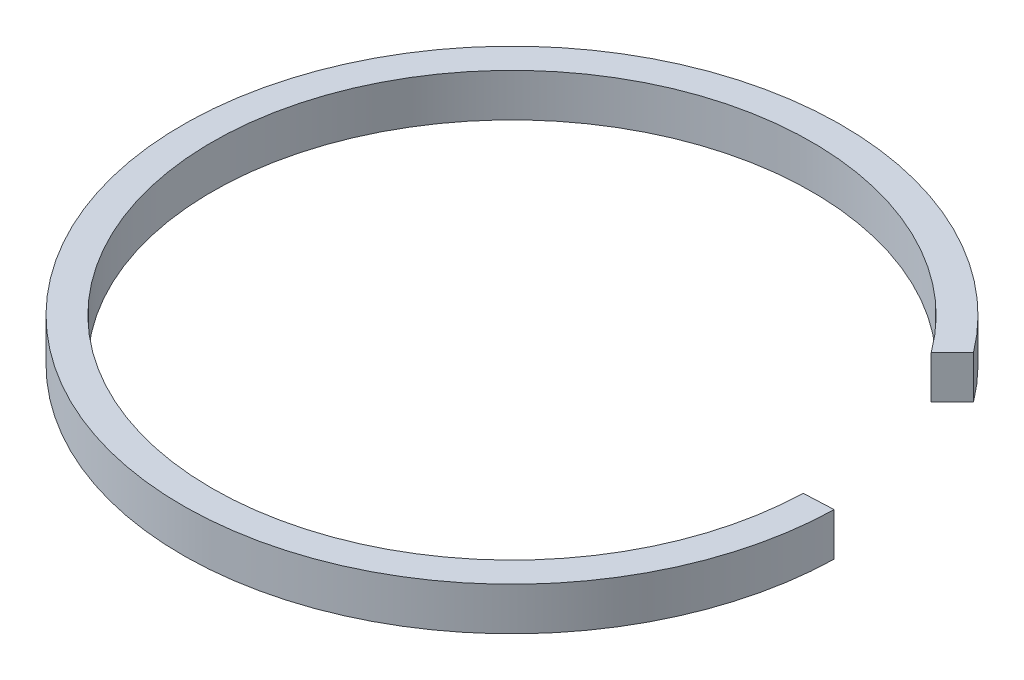
ISO-10303-21;
HEADER;
FILE_DESCRIPTION(('STEP AP214'),'2;1');
FILE_NAME('part.step','',(''),(''),'','','');
FILE_SCHEMA(('AUTOMOTIVE_DESIGN { 1 0 10303 214 1 1 1 1 }'));
ENDSEC;
DATA;
#1=APPLICATION_CONTEXT('core data for automotive mechanical design processes');
#2=APPLICATION_PROTOCOL_DEFINITION('international standard','automotive_design',2000,#1);
#3=PRODUCT_CONTEXT('',#1,'mechanical');
#4=PRODUCT('Part','Part','',(#3));
#5=PRODUCT_RELATED_PRODUCT_CATEGORY('part','',(#4));
#6=PRODUCT_DEFINITION_FORMATION('','',#4);
#7=PRODUCT_DEFINITION_CONTEXT('part definition',#1,'design');
#8=PRODUCT_DEFINITION('design','',#6,#7);
#9=PRODUCT_DEFINITION_SHAPE('','',#8);
#10=(LENGTH_UNIT() NAMED_UNIT(*) SI_UNIT(.MILLI.,.METRE.));
#11=(NAMED_UNIT(*) PLANE_ANGLE_UNIT() SI_UNIT($,.RADIAN.));
#12=(NAMED_UNIT(*) SI_UNIT($,.STERADIAN.) SOLID_ANGLE_UNIT());
#13=UNCERTAINTY_MEASURE_WITH_UNIT(LENGTH_MEASURE(1.E-05),#10,'distance_accuracy_value','');
#14=(GEOMETRIC_REPRESENTATION_CONTEXT(3) GLOBAL_UNCERTAINTY_ASSIGNED_CONTEXT((#13)) GLOBAL_UNIT_ASSIGNED_CONTEXT((#10,
#11,#12)) REPRESENTATION_CONTEXT('',''));
#15=CARTESIAN_POINT('',(0.,0.,0.));
#16=DIRECTION('',(0.,0.,1.));
#17=DIRECTION('',(1.,0.,0.));
#18=AXIS2_PLACEMENT_3D('',#15,#16,#17);
#19=CARTESIAN_POINT('',(145.719440182729,10.,-180.148984957569));
#20=DIRECTION('',(0.,-1.,0.));
#21=DIRECTION('',(0.,0.,-1.));
#22=AXIS2_PLACEMENT_3D('',#19,#20,#21);
#23=CYLINDRICAL_SURFACE('',#22,69.8715011577864);
#24=CARTESIAN_POINT('',(145.719440182729,0.,-180.148984957569));
#25=DIRECTION('',(0.,-1.,0.));
#26=DIRECTION('',(0.,0.,1.));
#27=AXIS2_PLACEMENT_3D('',#24,#25,#26);
#28=CIRCLE('',#27,69.8715011577864);
#29=CARTESIAN_POINT('',(215.562109822702,0.,-178.141954413675));
#30=VERTEX_POINT('',#29);
#31=CARTESIAN_POINT('',(202.062626742303,0.,-221.470553204134));
#32=VERTEX_POINT('',#31);
#33=EDGE_CURVE('E93',#30,#32,#28,.T.);
#34=ORIENTED_EDGE('',*,*,#33,.T.);
#35=DIRECTION('',(0.,-1.,0.));
#36=VECTOR('',#35,1.);
#37=CARTESIAN_POINT('',(202.062626742303,10.,-221.470553204134));
#38=LINE('',#37,#36);
#39=CARTESIAN_POINT('',(202.062626742303,10.,-221.470553204134));
#40=VERTEX_POINT('',#39);
#41=EDGE_CURVE('E11',#40,#32,#38,.T.);
#42=ORIENTED_EDGE('',*,*,#41,.F.);
#43=CARTESIAN_POINT('',(145.719440182729,10.,-180.148984957569));
#44=DIRECTION('',(0.,-1.,0.));
#45=DIRECTION('',(0.,0.,1.));
#46=AXIS2_PLACEMENT_3D('',#43,#44,#45);
#47=CIRCLE('',#46,69.8715011577864);
#48=CARTESIAN_POINT('',(215.562109822702,10.,-178.141954413675));
#49=VERTEX_POINT('',#48);
#50=EDGE_CURVE('E81',#49,#40,#47,.T.);
#51=ORIENTED_EDGE('',*,*,#50,.F.);
#52=DIRECTION('',(0.,-1.,0.));
#53=VECTOR('',#52,1.);
#54=CARTESIAN_POINT('',(215.562109822702,10.,-178.141954413675));
#55=LINE('',#54,#53);
#56=EDGE_CURVE('E89',#49,#30,#55,.T.);
#57=ORIENTED_EDGE('',*,*,#56,.T.);
#58=EDGE_LOOP('',(#34,#42,#51,#57));
#59=FACE_BOUND('',#58,.T.);
#60=ADVANCED_FACE('F30',(#59),#23,.F.);
#61=CARTESIAN_POINT('',(202.062626742303,10.,-221.470553204134));
#62=DIRECTION('',(-0.703375396347494,0.,-0.710818578691501));
#63=DIRECTION('',(-0.710818578691501,0.,0.703375396347494));
#64=AXIS2_PLACEMENT_3D('',#61,#62,#63);
#65=PLANE('',#64);
#66=DIRECTION('',(0.710818578691501,0.,-0.703375396347494));
#67=VECTOR('',#66,1.);
#68=CARTESIAN_POINT('',(202.062626742303,0.,-221.470553204134));
#69=LINE('',#68,#67);
#70=CARTESIAN_POINT('',(207.010266244838,0.,-226.366384574336));
#71=VERTEX_POINT('',#70);
#72=EDGE_CURVE('E85',#32,#71,#69,.T.);
#73=ORIENTED_EDGE('',*,*,#72,.T.);
#74=DIRECTION('',(0.,-1.,0.));
#75=VECTOR('',#74,1.);
#76=CARTESIAN_POINT('',(207.010266244838,10.,-226.366384574336));
#77=LINE('',#76,#75);
#78=CARTESIAN_POINT('',(207.010266244838,10.,-226.366384574336));
#79=VERTEX_POINT('',#78);
#80=EDGE_CURVE('E38',#79,#71,#77,.T.);
#81=ORIENTED_EDGE('',*,*,#80,.F.);
#82=DIRECTION('',(0.710818578691501,0.,-0.703375396347494));
#83=VECTOR('',#82,1.);
#84=CARTESIAN_POINT('',(202.062626742303,10.,-221.470553204134));
#85=LINE('',#84,#83);
#86=EDGE_CURVE('E76',#40,#79,#85,.T.);
#87=ORIENTED_EDGE('',*,*,#86,.F.);
#88=ORIENTED_EDGE('',*,*,#41,.T.);
#89=EDGE_LOOP('',(#73,#81,#87,#88));
#90=FACE_BOUND('',#89,.T.);
#91=ADVANCED_FACE('F84',(#90),#65,.F.);
#92=CARTESIAN_POINT('',(145.719440182729,10.,-180.148984957569));
#93=DIRECTION('',(0.,-1.,0.));
#94=DIRECTION('',(0.,0.,-1.));
#95=AXIS2_PLACEMENT_3D('',#92,#93,#94);
#96=CYLINDRICAL_SURFACE('',#95,76.7633596627426);
#97=CARTESIAN_POINT('',(145.719440182729,0.,-180.148984957569));
#98=DIRECTION('',(0.,1.,0.));
#99=DIRECTION('',(0.,0.,1.));
#100=AXIS2_PLACEMENT_3D('',#97,#98,#99);
#101=CIRCLE('',#100,76.7633596627426);
#102=CARTESIAN_POINT('',(222.464200691534,0.,-178.459274580656));
#103=VERTEX_POINT('',#102);
#104=EDGE_CURVE('E63',#71,#103,#101,.T.);
#105=ORIENTED_EDGE('',*,*,#104,.T.);
#106=DIRECTION('',(0.,-1.,0.));
#107=VECTOR('',#106,1.);
#108=CARTESIAN_POINT('',(222.464200691534,10.,-178.459274580656));
#109=LINE('',#108,#107);
#110=CARTESIAN_POINT('',(222.464200691534,10.,-178.459274580656));
#111=VERTEX_POINT('',#110);
#112=EDGE_CURVE('E86',#111,#103,#109,.T.);
#113=ORIENTED_EDGE('',*,*,#112,.F.);
#114=CARTESIAN_POINT('',(145.719440182729,10.,-180.148984957569));
#115=DIRECTION('',(0.,1.,0.));
#116=DIRECTION('',(0.,0.,1.));
#117=AXIS2_PLACEMENT_3D('',#114,#115,#116);
#118=CIRCLE('',#117,76.7633596627426);
#119=EDGE_CURVE('E79',#79,#111,#118,.T.);
#120=ORIENTED_EDGE('',*,*,#119,.F.);
#121=ORIENTED_EDGE('',*,*,#80,.T.);
#122=EDGE_LOOP('',(#105,#113,#120,#121));
#123=FACE_BOUND('',#122,.T.);
#124=ADVANCED_FACE('F87',(#123),#96,.T.);
#125=CARTESIAN_POINT('',(215.562109822702,10.,-178.141954413675));
#126=DIRECTION('',(0.0459259883828472,0.,0.998944845119619));
#127=DIRECTION('',(0.998944845119619,0.,-0.0459259883828472));
#128=AXIS2_PLACEMENT_3D('',#125,#126,#127);
#129=PLANE('',#128);
#130=DIRECTION('',(-0.998944845119619,0.,0.0459259883828472));
#131=VECTOR('',#130,1.);
#132=CARTESIAN_POINT('',(215.562109822702,0.,-178.141954413675));
#133=LINE('',#132,#131);
#134=EDGE_CURVE('E69',#103,#30,#133,.T.);
#135=ORIENTED_EDGE('',*,*,#134,.T.);
#136=ORIENTED_EDGE('',*,*,#56,.F.);
#137=DIRECTION('',(-0.998944845119619,0.,0.0459259883828472));
#138=VECTOR('',#137,1.);
#139=CARTESIAN_POINT('',(215.562109822702,10.,-178.141954413675));
#140=LINE('',#139,#138);
#141=EDGE_CURVE('E46',#111,#49,#140,.T.);
#142=ORIENTED_EDGE('',*,*,#141,.F.);
#143=ORIENTED_EDGE('',*,*,#112,.T.);
#144=EDGE_LOOP('',(#135,#136,#142,#143));
#145=FACE_BOUND('',#144,.T.);
#146=ADVANCED_FACE('F100',(#145),#129,.F.);
#147=CARTESIAN_POINT('',(145.719440182729,10.,-180.148984957569));
#148=DIRECTION('',(0.,1.,0.));
#149=DIRECTION('',(0.,0.,1.));
#150=AXIS2_PLACEMENT_3D('',#147,#148,#149);
#151=PLANE('',#150);
#152=ORIENTED_EDGE('',*,*,#50,.T.);
#153=ORIENTED_EDGE('',*,*,#86,.T.);
#154=ORIENTED_EDGE('',*,*,#119,.T.);
#155=ORIENTED_EDGE('',*,*,#141,.T.);
#156=EDGE_LOOP('',(#152,#153,#154,#155));
#157=FACE_BOUND('',#156,.T.);
#158=ADVANCED_FACE('F77',(#157),#151,.T.);
#159=CARTESIAN_POINT('',(145.719440182729,0.,-180.148984957569));
#160=DIRECTION('',(0.,1.,0.));
#161=DIRECTION('',(0.,0.,1.));
#162=AXIS2_PLACEMENT_3D('',#159,#160,#161);
#163=PLANE('',#162);
#164=ORIENTED_EDGE('',*,*,#33,.F.);
#165=ORIENTED_EDGE('',*,*,#134,.F.);
#166=ORIENTED_EDGE('',*,*,#104,.F.);
#167=ORIENTED_EDGE('',*,*,#72,.F.);
#168=EDGE_LOOP('',(#164,#165,#166,#167));
#169=FACE_BOUND('',#168,.T.);
#170=ADVANCED_FACE('F103',(#169),#163,.F.);
#171=CLOSED_SHELL('',(#60,#91,#124,#146,#158,#170));
#172=MANIFOLD_SOLID_BREP('B2',#171);
#173=ADVANCED_BREP_SHAPE_REPRESENTATION('',(#18,#172),#14);
#174=SHAPE_DEFINITION_REPRESENTATION(#9,#173);
ENDSEC;
END-ISO-10303-21;
